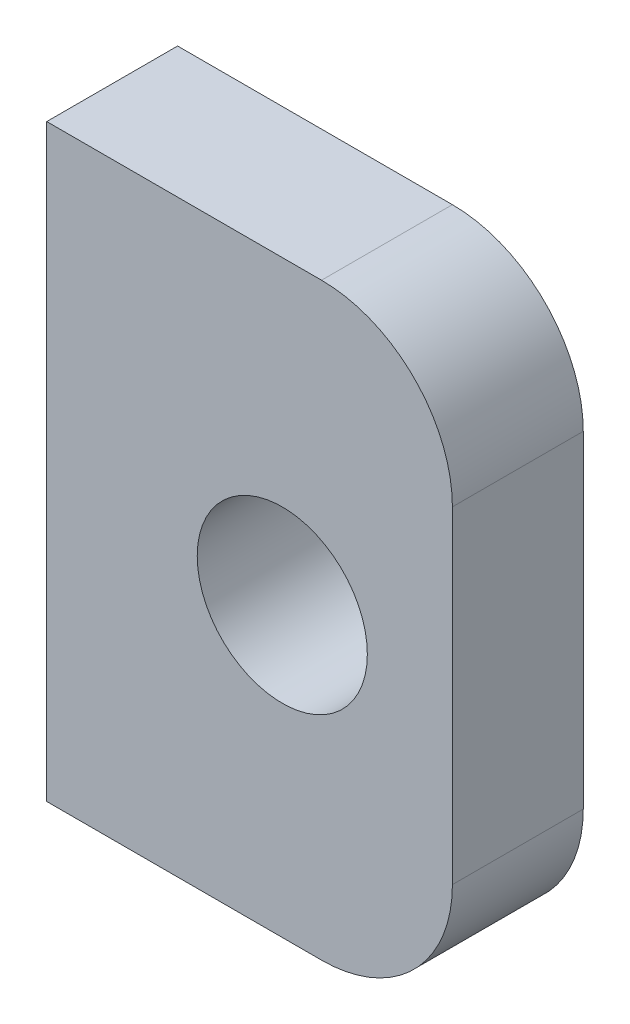
ISO-10303-21;
HEADER;
FILE_DESCRIPTION(('STEP AP214'),'2;1');
FILE_NAME('part.step','',(''),(''),'','','');
FILE_SCHEMA(('AUTOMOTIVE_DESIGN { 1 0 10303 214 1 1 1 1 }'));
ENDSEC;
DATA;
#1=APPLICATION_CONTEXT('core data for automotive mechanical design processes');
#2=APPLICATION_PROTOCOL_DEFINITION('international standard','automotive_design',2000,#1);
#3=PRODUCT_CONTEXT('',#1,'mechanical');
#4=PRODUCT('Part','Part','',(#3));
#5=PRODUCT_RELATED_PRODUCT_CATEGORY('part','',(#4));
#6=PRODUCT_DEFINITION_FORMATION('','',#4);
#7=PRODUCT_DEFINITION_CONTEXT('part definition',#1,'design');
#8=PRODUCT_DEFINITION('design','',#6,#7);
#9=PRODUCT_DEFINITION_SHAPE('','',#8);
#10=(LENGTH_UNIT() NAMED_UNIT(*) SI_UNIT(.MILLI.,.METRE.));
#11=(NAMED_UNIT(*) PLANE_ANGLE_UNIT() SI_UNIT($,.RADIAN.));
#12=(NAMED_UNIT(*) SI_UNIT($,.STERADIAN.) SOLID_ANGLE_UNIT());
#13=UNCERTAINTY_MEASURE_WITH_UNIT(LENGTH_MEASURE(1.E-05),#10,'distance_accuracy_value','');
#14=(GEOMETRIC_REPRESENTATION_CONTEXT(3) GLOBAL_UNCERTAINTY_ASSIGNED_CONTEXT((#13)) GLOBAL_UNIT_ASSIGNED_CONTEXT((#10,
#11,#12)) REPRESENTATION_CONTEXT('',''));
#15=CARTESIAN_POINT('',(0.,0.,0.));
#16=DIRECTION('',(0.,0.,1.));
#17=DIRECTION('',(1.,0.,0.));
#18=AXIS2_PLACEMENT_3D('',#15,#16,#17);
#19=CARTESIAN_POINT('',(50.9999999999975,795.000000000007,-891.089213425271));
#20=DIRECTION('',(0.999999999999997,0.,0.));
#21=DIRECTION('',(0.,-1.00000000000001,0.));
#22=AXIS2_PLACEMENT_3D('',#19,#20,#21);
#23=PLANE('',#22);
#24=DIRECTION('',(0.,0.,1.));
#25=VECTOR('',#24,1.);
#26=CARTESIAN_POINT('',(50.9999999999997,760.000000000007,-891.089213425271));
#27=LINE('',#26,#25);
#28=CARTESIAN_POINT('',(50.9999999999999,760.000000000007,-901.089213425271));
#29=VERTEX_POINT('',#28);
#30=CARTESIAN_POINT('',(50.9999999999997,760.000000000007,-891.089213425271));
#31=VERTEX_POINT('',#30);
#32=EDGE_CURVE('E11',#29,#31,#27,.T.);
#33=ORIENTED_EDGE('',*,*,#32,.F.);
#34=DIRECTION('',(0.,1.00000000000001,0.));
#35=VECTOR('',#34,1.);
#36=CARTESIAN_POINT('',(50.9999999999999,795.000000000007,-901.089213425271));
#37=LINE('',#36,#35);
#38=CARTESIAN_POINT('',(50.9999999999997,785.000000000007,-901.089213425271));
#39=VERTEX_POINT('',#38);
#40=EDGE_CURVE('E115',#39,#29,#37,.F.);
#41=ORIENTED_EDGE('',*,*,#40,.F.);
#42=DIRECTION('',(0.,0.,1.));
#43=VECTOR('',#42,1.);
#44=CARTESIAN_POINT('',(50.9999999999975,785.000000000007,-891.089213425271));
#45=LINE('',#44,#43);
#46=CARTESIAN_POINT('',(50.9999999999975,785.000000000007,-891.089213425271));
#47=VERTEX_POINT('',#46);
#48=EDGE_CURVE('E60',#39,#47,#45,.T.);
#49=ORIENTED_EDGE('',*,*,#48,.T.);
#50=DIRECTION('',(0.,-1.00000000000001,0.));
#51=VECTOR('',#50,1.);
#52=CARTESIAN_POINT('',(50.9999999999975,795.000000000007,-891.089213425271));
#53=LINE('',#52,#51);
#54=EDGE_CURVE('E159',#47,#31,#53,.T.);
#55=ORIENTED_EDGE('',*,*,#54,.T.);
#56=EDGE_LOOP('',(#33,#41,#49,#55));
#57=FACE_BOUND('',#56,.T.);
#58=ADVANCED_FACE('F49',(#57),#23,.T.);
#59=CARTESIAN_POINT('',(40.9999999999975,785.000000000008,-891.089213425271));
#60=DIRECTION('',(0.,0.,-1.));
#61=DIRECTION('',(-0.999999999999997,0.,0.));
#62=AXIS2_PLACEMENT_3D('',#59,#60,#61);
#63=CYLINDRICAL_SURFACE('',#62,10.);
#64=ORIENTED_EDGE('',*,*,#48,.F.);
#65=CARTESIAN_POINT('',(40.9999999999999,785.000000000008,-901.089213425271));
#66=DIRECTION('',(0.,0.,-1.));
#67=DIRECTION('',(-0.999999999999997,0.,0.));
#68=AXIS2_PLACEMENT_3D('',#65,#66,#67);
#69=CIRCLE('',#68,10.);
#70=CARTESIAN_POINT('',(40.9999999999999,795.000000000008,-901.089213425271));
#71=VERTEX_POINT('',#70);
#72=EDGE_CURVE('E138',#39,#71,#69,.F.);
#73=ORIENTED_EDGE('',*,*,#72,.T.);
#74=DIRECTION('',(0.,0.,1.));
#75=VECTOR('',#74,1.);
#76=CARTESIAN_POINT('',(40.9999999999975,795.000000000008,-891.089213425271));
#77=LINE('',#76,#75);
#78=CARTESIAN_POINT('',(40.9999999999975,795.000000000008,-891.089213425271));
#79=VERTEX_POINT('',#78);
#80=EDGE_CURVE('E148',#71,#79,#77,.T.);
#81=ORIENTED_EDGE('',*,*,#80,.T.);
#82=CARTESIAN_POINT('',(40.9999999999975,785.000000000008,-891.089213425271));
#83=DIRECTION('',(0.,0.,-1.));
#84=DIRECTION('',(-0.999999999999997,0.,0.));
#85=AXIS2_PLACEMENT_3D('',#82,#83,#84);
#86=CIRCLE('',#85,10.);
#87=EDGE_CURVE('E168',#47,#79,#86,.F.);
#88=ORIENTED_EDGE('',*,*,#87,.F.);
#89=EDGE_LOOP('',(#64,#73,#81,#88));
#90=FACE_BOUND('',#89,.T.);
#91=ADVANCED_FACE('F172',(#90),#63,.T.);
#92=CARTESIAN_POINT('',(50.9999999999975,795.000000000007,-891.089213425271));
#93=DIRECTION('',(0.,-1.00000000000001,0.));
#94=DIRECTION('',(-0.999999999999997,0.,0.));
#95=AXIS2_PLACEMENT_3D('',#92,#93,#94);
#96=PLANE('',#95);
#97=ORIENTED_EDGE('',*,*,#80,.F.);
#98=DIRECTION('',(-0.999999999999997,0.,0.));
#99=VECTOR('',#98,1.);
#100=CARTESIAN_POINT('',(50.9999999999999,795.000000000007,-901.089213425271));
#101=LINE('',#100,#99);
#102=CARTESIAN_POINT('',(20.,795.000000000007,-901.089213425269));
#103=VERTEX_POINT('',#102);
#104=EDGE_CURVE('E134',#71,#103,#101,.T.);
#105=ORIENTED_EDGE('',*,*,#104,.T.);
#106=DIRECTION('',(0.,0.,1.));
#107=VECTOR('',#106,1.);
#108=CARTESIAN_POINT('',(19.9999999999974,795.000000000007,-891.089213425269));
#109=LINE('',#108,#107);
#110=CARTESIAN_POINT('',(19.9999999999974,795.000000000007,-891.089213425269));
#111=VERTEX_POINT('',#110);
#112=EDGE_CURVE('E145',#103,#111,#109,.T.);
#113=ORIENTED_EDGE('',*,*,#112,.T.);
#114=DIRECTION('',(-0.999999999999997,0.,0.));
#115=VECTOR('',#114,1.);
#116=CARTESIAN_POINT('',(50.9999999999975,795.000000000007,-891.089213425271));
#117=LINE('',#116,#115);
#118=EDGE_CURVE('E173',#79,#111,#117,.T.);
#119=ORIENTED_EDGE('',*,*,#118,.F.);
#120=EDGE_LOOP('',(#97,#105,#113,#119));
#121=FACE_BOUND('',#120,.T.);
#122=ADVANCED_FACE('F187',(#121),#96,.F.);
#123=CARTESIAN_POINT('',(19.9999999999974,795.000000000007,-891.089213425269));
#124=DIRECTION('',(0.999999999999997,0.,0.));
#125=DIRECTION('',(0.,-1.00000000000001,0.));
#126=AXIS2_PLACEMENT_3D('',#123,#124,#125);
#127=PLANE('',#126);
#128=ORIENTED_EDGE('',*,*,#112,.F.);
#129=DIRECTION('',(0.,1.00000000000001,0.));
#130=VECTOR('',#129,1.);
#131=CARTESIAN_POINT('',(20.,795.000000000007,-901.089213425269));
#132=LINE('',#131,#130);
#133=CARTESIAN_POINT('',(20.,750.000000000007,-901.089213425269));
#134=VERTEX_POINT('',#133);
#135=EDGE_CURVE('E130',#103,#134,#132,.F.);
#136=ORIENTED_EDGE('',*,*,#135,.T.);
#137=DIRECTION('',(0.,0.,1.));
#138=VECTOR('',#137,1.);
#139=CARTESIAN_POINT('',(20.,750.000000000007,-891.089213425269));
#140=LINE('',#139,#138);
#141=CARTESIAN_POINT('',(20.,750.000000000007,-891.089213425269));
#142=VERTEX_POINT('',#141);
#143=EDGE_CURVE('E70',#134,#142,#140,.T.);
#144=ORIENTED_EDGE('',*,*,#143,.T.);
#145=DIRECTION('',(0.,-1.00000000000001,0.));
#146=VECTOR('',#145,1.);
#147=CARTESIAN_POINT('',(19.9999999999974,795.000000000007,-891.089213425269));
#148=LINE('',#147,#146);
#149=EDGE_CURVE('E108',#111,#142,#148,.T.);
#150=ORIENTED_EDGE('',*,*,#149,.F.);
#151=EDGE_LOOP('',(#128,#136,#144,#150));
#152=FACE_BOUND('',#151,.T.);
#153=ADVANCED_FACE('F184',(#152),#127,.F.);
#154=CARTESIAN_POINT('',(50.9999999999999,750.000000000007,-891.089213425271));
#155=DIRECTION('',(0.,-1.00000000000001,0.));
#156=DIRECTION('',(-0.999999999999997,0.,0.));
#157=AXIS2_PLACEMENT_3D('',#154,#155,#156);
#158=PLANE('',#157);
#159=ORIENTED_EDGE('',*,*,#143,.F.);
#160=DIRECTION('',(-0.999999999999997,0.,0.));
#161=VECTOR('',#160,1.);
#162=CARTESIAN_POINT('',(50.9999999999999,750.000000000007,-901.089213425271));
#163=LINE('',#162,#161);
#164=CARTESIAN_POINT('',(40.9999999999999,750.000000000008,-901.089213425271));
#165=VERTEX_POINT('',#164);
#166=EDGE_CURVE('E113',#165,#134,#163,.T.);
#167=ORIENTED_EDGE('',*,*,#166,.F.);
#168=DIRECTION('',(0.,0.,1.));
#169=VECTOR('',#168,1.);
#170=CARTESIAN_POINT('',(40.9999999999997,750.000000000008,-891.089213425271));
#171=LINE('',#170,#169);
#172=CARTESIAN_POINT('',(40.9999999999997,750.000000000008,-891.089213425271));
#173=VERTEX_POINT('',#172);
#174=EDGE_CURVE('E53',#165,#173,#171,.T.);
#175=ORIENTED_EDGE('',*,*,#174,.T.);
#176=DIRECTION('',(-0.999999999999997,0.,0.));
#177=VECTOR('',#176,1.);
#178=CARTESIAN_POINT('',(50.9999999999999,750.000000000007,-891.089213425271));
#179=LINE('',#178,#177);
#180=EDGE_CURVE('E183',#173,#142,#179,.T.);
#181=ORIENTED_EDGE('',*,*,#180,.T.);
#182=EDGE_LOOP('',(#159,#167,#175,#181));
#183=FACE_BOUND('',#182,.T.);
#184=ADVANCED_FACE('F118',(#183),#158,.T.);
#185=CARTESIAN_POINT('',(38.0000000000018,772.000000000008,-891.089213425269));
#186=DIRECTION('',(0.,0.,-1.));
#187=DIRECTION('',(-0.999999999999997,0.,0.));
#188=AXIS2_PLACEMENT_3D('',#185,#186,#187);
#189=CYLINDRICAL_SURFACE('',#188,6.5);
#190=CARTESIAN_POINT('',(38.0000000000018,772.000000000008,-891.089213425269));
#191=DIRECTION('',(0.,0.,1.));
#192=DIRECTION('',(0.999999999999997,0.,0.));
#193=AXIS2_PLACEMENT_3D('',#190,#191,#192);
#194=CIRCLE('',#193,6.5);
#195=CARTESIAN_POINT('',(44.5000000000018,772.000000000008,-891.089213425269));
#196=VERTEX_POINT('',#195);
#197=EDGE_CURVE('E133',#196,#196,#194,.T.);
#198=ORIENTED_EDGE('',*,*,#197,.T.);
#199=EDGE_LOOP('',(#198));
#200=FACE_BOUND('',#199,.T.);
#201=CARTESIAN_POINT('',(38.0000000000018,772.000000000008,-901.089213425269));
#202=DIRECTION('',(0.,0.,1.));
#203=DIRECTION('',(0.999999999999997,0.,0.));
#204=AXIS2_PLACEMENT_3D('',#201,#202,#203);
#205=CIRCLE('',#204,6.5);
#206=CARTESIAN_POINT('',(44.5000000000018,772.000000000008,-901.089213425269));
#207=VERTEX_POINT('',#206);
#208=EDGE_CURVE('E120',#207,#207,#205,.T.);
#209=ORIENTED_EDGE('',*,*,#208,.F.);
#210=EDGE_LOOP('',(#209));
#211=FACE_BOUND('',#210,.T.);
#212=ADVANCED_FACE('F215',(#200,#211),#189,.F.);
#213=CARTESIAN_POINT('',(40.9999999999999,760.000000000008,-891.089213425271));
#214=DIRECTION('',(0.,0.,-1.));
#215=DIRECTION('',(-0.999999999999997,0.,0.));
#216=AXIS2_PLACEMENT_3D('',#213,#214,#215);
#217=CYLINDRICAL_SURFACE('',#216,10.);
#218=CARTESIAN_POINT('',(41.0000000000001,760.000000000008,-901.089213425271));
#219=DIRECTION('',(0.,0.,-1.));
#220=DIRECTION('',(-0.999999999999997,0.,0.));
#221=AXIS2_PLACEMENT_3D('',#218,#219,#220);
#222=CIRCLE('',#221,10.);
#223=EDGE_CURVE('E101',#165,#29,#222,.F.);
#224=ORIENTED_EDGE('',*,*,#223,.T.);
#225=ORIENTED_EDGE('',*,*,#32,.T.);
#226=CARTESIAN_POINT('',(40.9999999999999,760.000000000008,-891.089213425271));
#227=DIRECTION('',(0.,0.,-1.));
#228=DIRECTION('',(-0.999999999999997,0.,0.));
#229=AXIS2_PLACEMENT_3D('',#226,#227,#228);
#230=CIRCLE('',#229,10.);
#231=EDGE_CURVE('E103',#173,#31,#230,.F.);
#232=ORIENTED_EDGE('',*,*,#231,.F.);
#233=ORIENTED_EDGE('',*,*,#174,.F.);
#234=EDGE_LOOP('',(#224,#225,#232,#233));
#235=FACE_BOUND('',#234,.T.);
#236=ADVANCED_FACE('F51',(#235),#217,.T.);
#237=CARTESIAN_POINT('',(50.9999999999975,795.000000000007,-891.089213425271));
#238=DIRECTION('',(0.,0.,-1.));
#239=DIRECTION('',(-0.999999999999997,0.,0.));
#240=AXIS2_PLACEMENT_3D('',#237,#238,#239);
#241=PLANE('',#240);
#242=ORIENTED_EDGE('',*,*,#197,.F.);
#243=EDGE_LOOP('',(#242));
#244=FACE_BOUND('',#243,.T.);
#245=ORIENTED_EDGE('',*,*,#180,.F.);
#246=ORIENTED_EDGE('',*,*,#231,.T.);
#247=ORIENTED_EDGE('',*,*,#54,.F.);
#248=ORIENTED_EDGE('',*,*,#87,.T.);
#249=ORIENTED_EDGE('',*,*,#118,.T.);
#250=ORIENTED_EDGE('',*,*,#149,.T.);
#251=EDGE_LOOP('',(#245,#246,#247,#248,#249,#250));
#252=FACE_BOUND('',#251,.T.);
#253=ADVANCED_FACE('F166',(#244,#252),#241,.F.);
#254=CARTESIAN_POINT('',(50.9999999999999,795.000000000007,-901.089213425271));
#255=DIRECTION('',(0.,0.,-1.));
#256=DIRECTION('',(-0.999999999999997,0.,0.));
#257=AXIS2_PLACEMENT_3D('',#254,#255,#256);
#258=PLANE('',#257);
#259=ORIENTED_EDGE('',*,*,#208,.T.);
#260=EDGE_LOOP('',(#259));
#261=FACE_BOUND('',#260,.T.);
#262=ORIENTED_EDGE('',*,*,#166,.T.);
#263=ORIENTED_EDGE('',*,*,#135,.F.);
#264=ORIENTED_EDGE('',*,*,#104,.F.);
#265=ORIENTED_EDGE('',*,*,#72,.F.);
#266=ORIENTED_EDGE('',*,*,#40,.T.);
#267=ORIENTED_EDGE('',*,*,#223,.F.);
#268=EDGE_LOOP('',(#262,#263,#264,#265,#266,#267));
#269=FACE_BOUND('',#268,.T.);
#270=ADVANCED_FACE('F111',(#261,#269),#258,.T.);
#271=CLOSED_SHELL('',(#58,#91,#122,#153,#184,#212,#236,#253,#270));
#272=MANIFOLD_SOLID_BREP('B2',#271);
#273=ADVANCED_BREP_SHAPE_REPRESENTATION('',(#18,#272),#14);
#274=SHAPE_DEFINITION_REPRESENTATION(#9,#273);
ENDSEC;
END-ISO-10303-21;
